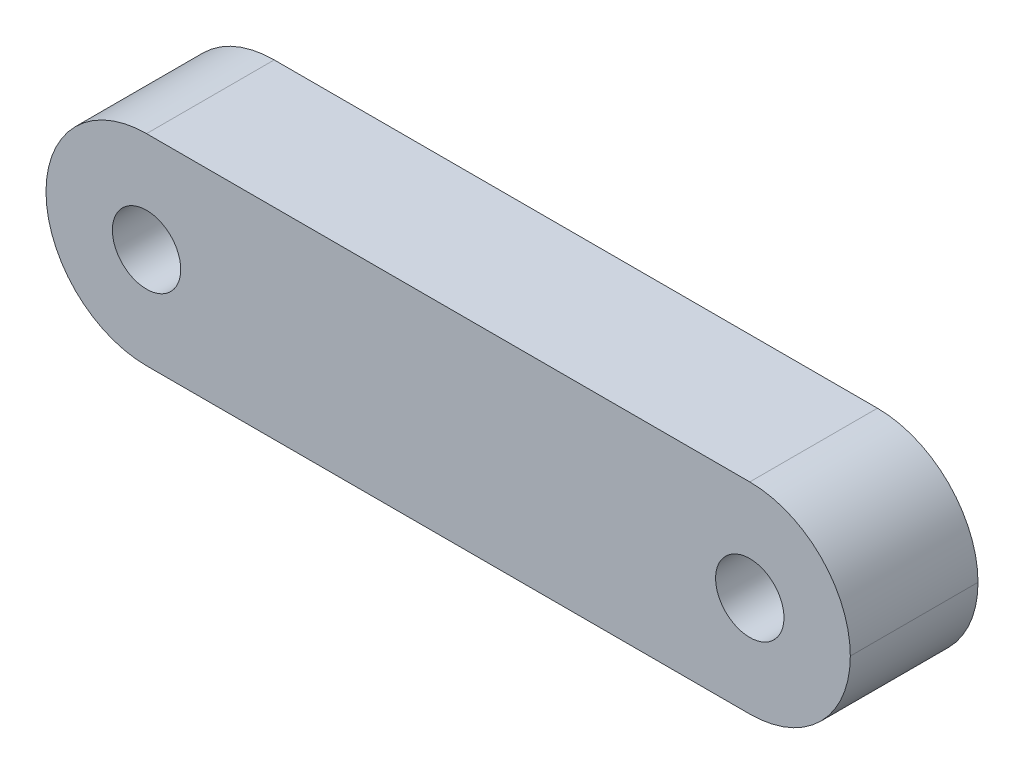
ISO-10303-21;
HEADER;
FILE_DESCRIPTION(('STEP AP214'),'2;1');
FILE_NAME('part.step','',(''),(''),'','','');
FILE_SCHEMA(('AUTOMOTIVE_DESIGN { 1 0 10303 214 1 1 1 1 }'));
ENDSEC;
DATA;
#1=APPLICATION_CONTEXT('core data for automotive mechanical design processes');
#2=APPLICATION_PROTOCOL_DEFINITION('international standard','automotive_design',2000,#1);
#3=PRODUCT_CONTEXT('',#1,'mechanical');
#4=PRODUCT('Part','Part','',(#3));
#5=PRODUCT_RELATED_PRODUCT_CATEGORY('part','',(#4));
#6=PRODUCT_DEFINITION_FORMATION('','',#4);
#7=PRODUCT_DEFINITION_CONTEXT('part definition',#1,'design');
#8=PRODUCT_DEFINITION('design','',#6,#7);
#9=PRODUCT_DEFINITION_SHAPE('','',#8);
#10=(LENGTH_UNIT() NAMED_UNIT(*) SI_UNIT(.MILLI.,.METRE.));
#11=(NAMED_UNIT(*) PLANE_ANGLE_UNIT() SI_UNIT($,.RADIAN.));
#12=(NAMED_UNIT(*) SI_UNIT($,.STERADIAN.) SOLID_ANGLE_UNIT());
#13=UNCERTAINTY_MEASURE_WITH_UNIT(LENGTH_MEASURE(1.E-05),#10,'distance_accuracy_value','');
#14=(GEOMETRIC_REPRESENTATION_CONTEXT(3) GLOBAL_UNCERTAINTY_ASSIGNED_CONTEXT((#13)) GLOBAL_UNIT_ASSIGNED_CONTEXT((#10,
#11,#12)) REPRESENTATION_CONTEXT('',''));
#15=CARTESIAN_POINT('',(0.,0.,0.));
#16=DIRECTION('',(0.,0.,1.));
#17=DIRECTION('',(1.,0.,0.));
#18=AXIS2_PLACEMENT_3D('',#15,#16,#17);
#19=CARTESIAN_POINT('',(0.,0.,6.35));
#20=DIRECTION('',(0.,1.,0.));
#21=DIRECTION('',(0.,0.,1.));
#22=AXIS2_PLACEMENT_3D('',#19,#20,#21);
#23=PLANE('',#22);
#24=DIRECTION('',(1.,0.,0.));
#25=VECTOR('',#24,1.);
#26=CARTESIAN_POINT('',(0.,0.,6.35));
#27=LINE('',#26,#25);
#28=CARTESIAN_POINT('',(5.,0.,6.35));
#29=VERTEX_POINT('',#28);
#30=CARTESIAN_POINT('',(35.,0.,6.35));
#31=VERTEX_POINT('',#30);
#32=EDGE_CURVE('E102',#29,#31,#27,.T.);
#33=ORIENTED_EDGE('',*,*,#32,.F.);
#34=DIRECTION('',(0.,0.,-1.));
#35=VECTOR('',#34,1.);
#36=CARTESIAN_POINT('',(5.,0.,0.));
#37=LINE('',#36,#35);
#38=CARTESIAN_POINT('',(5.,0.,0.));
#39=VERTEX_POINT('',#38);
#40=EDGE_CURVE('E11',#29,#39,#37,.T.);
#41=ORIENTED_EDGE('',*,*,#40,.T.);
#42=DIRECTION('',(1.,0.,0.));
#43=VECTOR('',#42,1.);
#44=CARTESIAN_POINT('',(0.,0.,0.));
#45=LINE('',#44,#43);
#46=CARTESIAN_POINT('',(35.,0.,0.));
#47=VERTEX_POINT('',#46);
#48=EDGE_CURVE('E100',#39,#47,#45,.T.);
#49=ORIENTED_EDGE('',*,*,#48,.T.);
#50=DIRECTION('',(0.,0.,-1.));
#51=VECTOR('',#50,1.);
#52=CARTESIAN_POINT('',(35.,0.,6.35));
#53=LINE('',#52,#51);
#54=EDGE_CURVE('E53',#47,#31,#53,.F.);
#55=ORIENTED_EDGE('',*,*,#54,.T.);
#56=EDGE_LOOP('',(#33,#41,#49,#55));
#57=FACE_BOUND('',#56,.T.);
#58=ADVANCED_FACE('F43',(#57),#23,.F.);
#59=CARTESIAN_POINT('',(0.,10.,6.35));
#60=DIRECTION('',(0.,1.,0.));
#61=DIRECTION('',(0.,0.,1.));
#62=AXIS2_PLACEMENT_3D('',#59,#60,#61);
#63=PLANE('',#62);
#64=DIRECTION('',(1.,0.,0.));
#65=VECTOR('',#64,1.);
#66=CARTESIAN_POINT('',(0.,10.,0.));
#67=LINE('',#66,#65);
#68=CARTESIAN_POINT('',(5.,10.,0.));
#69=VERTEX_POINT('',#68);
#70=CARTESIAN_POINT('',(35.,10.,0.));
#71=VERTEX_POINT('',#70);
#72=EDGE_CURVE('E112',#69,#71,#67,.T.);
#73=ORIENTED_EDGE('',*,*,#72,.F.);
#74=DIRECTION('',(0.,0.,-1.));
#75=VECTOR('',#74,1.);
#76=CARTESIAN_POINT('',(5.,10.,6.35));
#77=LINE('',#76,#75);
#78=CARTESIAN_POINT('',(5.,10.,6.35));
#79=VERTEX_POINT('',#78);
#80=EDGE_CURVE('E133',#69,#79,#77,.F.);
#81=ORIENTED_EDGE('',*,*,#80,.T.);
#82=DIRECTION('',(1.,0.,0.));
#83=VECTOR('',#82,1.);
#84=CARTESIAN_POINT('',(0.,10.,6.35));
#85=LINE('',#84,#83);
#86=CARTESIAN_POINT('',(35.,10.,6.35));
#87=VERTEX_POINT('',#86);
#88=EDGE_CURVE('E162',#79,#87,#85,.T.);
#89=ORIENTED_EDGE('',*,*,#88,.T.);
#90=DIRECTION('',(0.,0.,-1.));
#91=VECTOR('',#90,1.);
#92=CARTESIAN_POINT('',(35.,10.,0.));
#93=LINE('',#92,#91);
#94=EDGE_CURVE('E125',#87,#71,#93,.T.);
#95=ORIENTED_EDGE('',*,*,#94,.T.);
#96=EDGE_LOOP('',(#73,#81,#89,#95));
#97=FACE_BOUND('',#96,.T.);
#98=ADVANCED_FACE('F194',(#97),#63,.T.);
#99=CARTESIAN_POINT('',(35.,5.,6.35));
#100=DIRECTION('',(0.,0.,-1.));
#101=DIRECTION('',(-1.,0.,0.));
#102=AXIS2_PLACEMENT_3D('',#99,#100,#101);
#103=CYLINDRICAL_SURFACE('',#102,1.7);
#104=CARTESIAN_POINT('',(35.,5.,6.35));
#105=DIRECTION('',(0.,0.,1.));
#106=DIRECTION('',(1.,0.,0.));
#107=AXIS2_PLACEMENT_3D('',#104,#105,#106);
#108=CIRCLE('',#107,1.7);
#109=CARTESIAN_POINT('',(36.7,5.,6.35));
#110=VERTEX_POINT('',#109);
#111=EDGE_CURVE('E176',#110,#110,#108,.T.);
#112=ORIENTED_EDGE('',*,*,#111,.T.);
#113=EDGE_LOOP('',(#112));
#114=FACE_BOUND('',#113,.T.);
#115=CARTESIAN_POINT('',(35.,5.,0.));
#116=DIRECTION('',(0.,0.,1.));
#117=DIRECTION('',(1.,0.,0.));
#118=AXIS2_PLACEMENT_3D('',#115,#116,#117);
#119=CIRCLE('',#118,1.7);
#120=CARTESIAN_POINT('',(36.7,5.,0.));
#121=VERTEX_POINT('',#120);
#122=EDGE_CURVE('E113',#121,#121,#119,.T.);
#123=ORIENTED_EDGE('',*,*,#122,.F.);
#124=EDGE_LOOP('',(#123));
#125=FACE_BOUND('',#124,.T.);
#126=ADVANCED_FACE('F210',(#114,#125),#103,.F.);
#127=CARTESIAN_POINT('',(5.,5.,6.35));
#128=DIRECTION('',(0.,0.,-1.));
#129=DIRECTION('',(-1.,0.,0.));
#130=AXIS2_PLACEMENT_3D('',#127,#128,#129);
#131=CYLINDRICAL_SURFACE('',#130,1.7);
#132=CARTESIAN_POINT('',(5.,5.,6.35));
#133=DIRECTION('',(0.,0.,1.));
#134=DIRECTION('',(1.,0.,0.));
#135=AXIS2_PLACEMENT_3D('',#132,#133,#134);
#136=CIRCLE('',#135,1.7);
#137=CARTESIAN_POINT('',(6.7,5.,6.35));
#138=VERTEX_POINT('',#137);
#139=EDGE_CURVE('E169',#138,#138,#136,.T.);
#140=ORIENTED_EDGE('',*,*,#139,.T.);
#141=EDGE_LOOP('',(#140));
#142=FACE_BOUND('',#141,.T.);
#143=CARTESIAN_POINT('',(5.,5.,0.));
#144=DIRECTION('',(0.,0.,1.));
#145=DIRECTION('',(1.,0.,0.));
#146=AXIS2_PLACEMENT_3D('',#143,#144,#145);
#147=CIRCLE('',#146,1.7);
#148=CARTESIAN_POINT('',(6.7,5.,0.));
#149=VERTEX_POINT('',#148);
#150=EDGE_CURVE('E149',#149,#149,#147,.T.);
#151=ORIENTED_EDGE('',*,*,#150,.F.);
#152=EDGE_LOOP('',(#151));
#153=FACE_BOUND('',#152,.T.);
#154=ADVANCED_FACE('F184',(#142,#153),#131,.F.);
#155=CARTESIAN_POINT('',(0.,0.,6.35));
#156=DIRECTION('',(0.,0.,1.));
#157=DIRECTION('',(1.,0.,0.));
#158=AXIS2_PLACEMENT_3D('',#155,#156,#157);
#159=PLANE('',#158);
#160=ORIENTED_EDGE('',*,*,#139,.F.);
#161=EDGE_LOOP('',(#160));
#162=FACE_BOUND('',#161,.T.);
#163=ORIENTED_EDGE('',*,*,#111,.F.);
#164=EDGE_LOOP('',(#163));
#165=FACE_BOUND('',#164,.T.);
#166=ORIENTED_EDGE('',*,*,#88,.F.);
#167=CARTESIAN_POINT('',(5.,5.,6.35));
#168=DIRECTION('',(0.,0.,1.));
#169=DIRECTION('',(1.,0.,0.));
#170=AXIS2_PLACEMENT_3D('',#167,#168,#169);
#171=CIRCLE('',#170,5.);
#172=CARTESIAN_POINT('',(0.,5.,6.35));
#173=VERTEX_POINT('',#172);
#174=EDGE_CURVE('E61',#79,#173,#171,.T.);
#175=ORIENTED_EDGE('',*,*,#174,.T.);
#176=CARTESIAN_POINT('',(5.,5.,6.35));
#177=DIRECTION('',(0.,0.,1.));
#178=DIRECTION('',(1.,0.,0.));
#179=AXIS2_PLACEMENT_3D('',#176,#177,#178);
#180=CIRCLE('',#179,5.);
#181=EDGE_CURVE('E142',#173,#29,#180,.T.);
#182=ORIENTED_EDGE('',*,*,#181,.T.);
#183=ORIENTED_EDGE('',*,*,#32,.T.);
#184=CARTESIAN_POINT('',(35.,5.,6.35));
#185=DIRECTION('',(0.,0.,1.));
#186=DIRECTION('',(1.,0.,0.));
#187=AXIS2_PLACEMENT_3D('',#184,#185,#186);
#188=CIRCLE('',#187,5.);
#189=CARTESIAN_POINT('',(40.,5.,6.35));
#190=VERTEX_POINT('',#189);
#191=EDGE_CURVE('E68',#31,#190,#188,.T.);
#192=ORIENTED_EDGE('',*,*,#191,.T.);
#193=CARTESIAN_POINT('',(35.,5.,6.35));
#194=DIRECTION('',(0.,0.,1.));
#195=DIRECTION('',(1.,0.,0.));
#196=AXIS2_PLACEMENT_3D('',#193,#194,#195);
#197=CIRCLE('',#196,5.);
#198=EDGE_CURVE('E139',#190,#87,#197,.T.);
#199=ORIENTED_EDGE('',*,*,#198,.T.);
#200=EDGE_LOOP('',(#166,#175,#182,#183,#192,#199));
#201=FACE_BOUND('',#200,.T.);
#202=ADVANCED_FACE('F187',(#162,#165,#201),#159,.T.);
#203=CARTESIAN_POINT('',(0.,0.,0.));
#204=DIRECTION('',(0.,0.,1.));
#205=DIRECTION('',(1.,0.,0.));
#206=AXIS2_PLACEMENT_3D('',#203,#204,#205);
#207=PLANE('',#206);
#208=ORIENTED_EDGE('',*,*,#150,.T.);
#209=EDGE_LOOP('',(#208));
#210=FACE_BOUND('',#209,.T.);
#211=ORIENTED_EDGE('',*,*,#122,.T.);
#212=EDGE_LOOP('',(#211));
#213=FACE_BOUND('',#212,.T.);
#214=CARTESIAN_POINT('',(5.,5.,0.));
#215=DIRECTION('',(0.,0.,1.));
#216=DIRECTION('',(1.,0.,0.));
#217=AXIS2_PLACEMENT_3D('',#214,#215,#216);
#218=CIRCLE('',#217,5.);
#219=CARTESIAN_POINT('',(0.,5.,0.));
#220=VERTEX_POINT('',#219);
#221=EDGE_CURVE('E107',#39,#220,#218,.F.);
#222=ORIENTED_EDGE('',*,*,#221,.T.);
#223=CARTESIAN_POINT('',(5.,5.,0.));
#224=DIRECTION('',(0.,0.,1.));
#225=DIRECTION('',(1.,0.,0.));
#226=AXIS2_PLACEMENT_3D('',#223,#224,#225);
#227=CIRCLE('',#226,5.);
#228=EDGE_CURVE('E120',#220,#69,#227,.F.);
#229=ORIENTED_EDGE('',*,*,#228,.T.);
#230=ORIENTED_EDGE('',*,*,#72,.T.);
#231=CARTESIAN_POINT('',(35.,5.,0.));
#232=DIRECTION('',(0.,0.,1.));
#233=DIRECTION('',(1.,0.,0.));
#234=AXIS2_PLACEMENT_3D('',#231,#232,#233);
#235=CIRCLE('',#234,5.);
#236=CARTESIAN_POINT('',(40.,5.,0.));
#237=VERTEX_POINT('',#236);
#238=EDGE_CURVE('E121',#71,#237,#235,.F.);
#239=ORIENTED_EDGE('',*,*,#238,.T.);
#240=CARTESIAN_POINT('',(35.,5.,0.));
#241=DIRECTION('',(0.,0.,1.));
#242=DIRECTION('',(1.,0.,0.));
#243=AXIS2_PLACEMENT_3D('',#240,#241,#242);
#244=CIRCLE('',#243,5.);
#245=EDGE_CURVE('E110',#237,#47,#244,.F.);
#246=ORIENTED_EDGE('',*,*,#245,.T.);
#247=ORIENTED_EDGE('',*,*,#48,.F.);
#248=EDGE_LOOP('',(#222,#229,#230,#239,#246,#247));
#249=FACE_BOUND('',#248,.T.);
#250=ADVANCED_FACE('F106',(#210,#213,#249),#207,.F.);
#251=CARTESIAN_POINT('',(5.,5.,6.35));
#252=DIRECTION('',(0.,0.,1.));
#253=DIRECTION('',(1.,0.,0.));
#254=AXIS2_PLACEMENT_3D('',#251,#252,#253);
#255=CYLINDRICAL_SURFACE('',#254,5.);
#256=ORIENTED_EDGE('',*,*,#40,.F.);
#257=ORIENTED_EDGE('',*,*,#181,.F.);
#258=DIRECTION('',(0.,0.,-1.));
#259=VECTOR('',#258,1.);
#260=CARTESIAN_POINT('',(0.,5.,6.35));
#261=LINE('',#260,#259);
#262=EDGE_CURVE('E117',#220,#173,#261,.F.);
#263=ORIENTED_EDGE('',*,*,#262,.F.);
#264=ORIENTED_EDGE('',*,*,#221,.F.);
#265=EDGE_LOOP('',(#256,#257,#263,#264));
#266=FACE_BOUND('',#265,.T.);
#267=ADVANCED_FACE('F115',(#266),#255,.T.);
#268=CARTESIAN_POINT('',(5.,5.,6.35));
#269=DIRECTION('',(0.,0.,-1.));
#270=DIRECTION('',(-1.,0.,0.));
#271=AXIS2_PLACEMENT_3D('',#268,#269,#270);
#272=CYLINDRICAL_SURFACE('',#271,5.);
#273=ORIENTED_EDGE('',*,*,#174,.F.);
#274=ORIENTED_EDGE('',*,*,#80,.F.);
#275=ORIENTED_EDGE('',*,*,#228,.F.);
#276=ORIENTED_EDGE('',*,*,#262,.T.);
#277=EDGE_LOOP('',(#273,#274,#275,#276));
#278=FACE_BOUND('',#277,.T.);
#279=ADVANCED_FACE('F196',(#278),#272,.T.);
#280=CARTESIAN_POINT('',(35.,5.,6.35));
#281=DIRECTION('',(0.,0.,-1.));
#282=DIRECTION('',(-1.,0.,0.));
#283=AXIS2_PLACEMENT_3D('',#280,#281,#282);
#284=CYLINDRICAL_SURFACE('',#283,5.);
#285=DIRECTION('',(0.,0.,-1.));
#286=VECTOR('',#285,1.);
#287=CARTESIAN_POINT('',(40.,5.,6.35));
#288=LINE('',#287,#286);
#289=EDGE_CURVE('E47',#190,#237,#288,.T.);
#290=ORIENTED_EDGE('',*,*,#289,.F.);
#291=ORIENTED_EDGE('',*,*,#191,.F.);
#292=ORIENTED_EDGE('',*,*,#54,.F.);
#293=ORIENTED_EDGE('',*,*,#245,.F.);
#294=EDGE_LOOP('',(#290,#291,#292,#293));
#295=FACE_BOUND('',#294,.T.);
#296=ADVANCED_FACE('F45',(#295),#284,.T.);
#297=CARTESIAN_POINT('',(35.,5.,6.35));
#298=DIRECTION('',(0.,0.,1.));
#299=DIRECTION('',(1.,0.,0.));
#300=AXIS2_PLACEMENT_3D('',#297,#298,#299);
#301=CYLINDRICAL_SURFACE('',#300,5.);
#302=ORIENTED_EDGE('',*,*,#198,.F.);
#303=ORIENTED_EDGE('',*,*,#289,.T.);
#304=ORIENTED_EDGE('',*,*,#238,.F.);
#305=ORIENTED_EDGE('',*,*,#94,.F.);
#306=EDGE_LOOP('',(#302,#303,#304,#305));
#307=FACE_BOUND('',#306,.T.);
#308=ADVANCED_FACE('F158',(#307),#301,.T.);
#309=CLOSED_SHELL('',(#58,#98,#126,#154,#202,#250,#267,#279,#296,#308));
#310=MANIFOLD_SOLID_BREP('B2',#309);
#311=ADVANCED_BREP_SHAPE_REPRESENTATION('',(#18,#310),#14);
#312=SHAPE_DEFINITION_REPRESENTATION(#9,#311);
ENDSEC;
END-ISO-10303-21;
